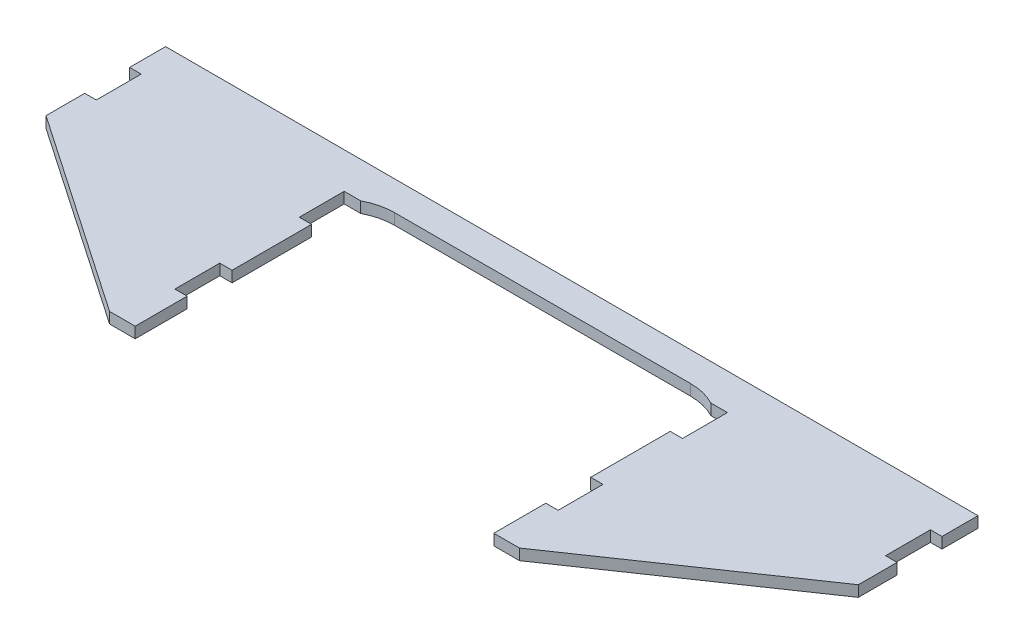
ISO-10303-21;
HEADER;
FILE_DESCRIPTION(('STEP AP214'),'2;1');
FILE_NAME('part.step','',(''),(''),'','','');
FILE_SCHEMA(('AUTOMOTIVE_DESIGN { 1 0 10303 214 1 1 1 1 }'));
ENDSEC;
DATA;
#1=APPLICATION_CONTEXT('core data for automotive mechanical design processes');
#2=APPLICATION_PROTOCOL_DEFINITION('international standard','automotive_design',2000,#1);
#3=PRODUCT_CONTEXT('',#1,'mechanical');
#4=PRODUCT('Part','Part','',(#3));
#5=PRODUCT_RELATED_PRODUCT_CATEGORY('part','',(#4));
#6=PRODUCT_DEFINITION_FORMATION('','',#4);
#7=PRODUCT_DEFINITION_CONTEXT('part definition',#1,'design');
#8=PRODUCT_DEFINITION('design','',#6,#7);
#9=PRODUCT_DEFINITION_SHAPE('','',#8);
#10=(LENGTH_UNIT() NAMED_UNIT(*) SI_UNIT(.MILLI.,.METRE.));
#11=(NAMED_UNIT(*) PLANE_ANGLE_UNIT() SI_UNIT($,.RADIAN.));
#12=(NAMED_UNIT(*) SI_UNIT($,.STERADIAN.) SOLID_ANGLE_UNIT());
#13=UNCERTAINTY_MEASURE_WITH_UNIT(LENGTH_MEASURE(1.E-05),#10,'distance_accuracy_value','');
#14=(GEOMETRIC_REPRESENTATION_CONTEXT(3) GLOBAL_UNCERTAINTY_ASSIGNED_CONTEXT((#13)) GLOBAL_UNIT_ASSIGNED_CONTEXT((#10,
#11,#12)) REPRESENTATION_CONTEXT('',''));
#15=CARTESIAN_POINT('',(0.,0.,0.));
#16=DIRECTION('',(0.,0.,1.));
#17=DIRECTION('',(1.,0.,0.));
#18=AXIS2_PLACEMENT_3D('',#15,#16,#17);
#19=CARTESIAN_POINT('',(-82.8040000000002,-4.99999999997031E-05,9.69232132136487));
#20=DIRECTION('',(0.,0.,1.));
#21=DIRECTION('',(1.,0.,0.));
#22=AXIS2_PLACEMENT_3D('',#19,#20,#21);
#23=PLANE('',#22);
#24=DIRECTION('',(1.,0.,0.));
#25=VECTOR('',#24,1.);
#26=CARTESIAN_POINT('',(-82.8040000000002,4.7625,9.69232132136487));
#27=LINE('',#26,#25);
#28=CARTESIAN_POINT('',(-83.1215000000002,4.7625,9.69232132136487));
#29=VERTEX_POINT('',#28);
#30=CARTESIAN_POINT('',(-77.7875,4.7625,9.69232132136487));
#31=VERTEX_POINT('',#30);
#32=EDGE_CURVE('E287',#29,#31,#27,.T.);
#33=ORIENTED_EDGE('',*,*,#32,.T.);
#34=DIRECTION('',(0.,1.,0.));
#35=VECTOR('',#34,1.);
#36=CARTESIAN_POINT('',(-77.7875,0.,9.69232132136487));
#37=LINE('',#36,#35);
#38=CARTESIAN_POINT('',(-77.7875,0.,9.69232132136487));
#39=VERTEX_POINT('',#38);
#40=EDGE_CURVE('E258',#39,#31,#37,.T.);
#41=ORIENTED_EDGE('',*,*,#40,.F.);
#42=DIRECTION('',(1.,0.,0.));
#43=VECTOR('',#42,1.);
#44=CARTESIAN_POINT('',(0.,0.,9.69232132136487));
#45=LINE('',#44,#43);
#46=CARTESIAN_POINT('',(-83.1215000000002,0.,9.69232132136487));
#47=VERTEX_POINT('',#46);
#48=EDGE_CURVE('E279',#47,#39,#45,.T.);
#49=ORIENTED_EDGE('',*,*,#48,.F.);
#50=DIRECTION('',(0.,1.,0.));
#51=VECTOR('',#50,1.);
#52=CARTESIAN_POINT('',(-83.1215000000002,0.,9.69232132136487));
#53=LINE('',#52,#51);
#54=EDGE_CURVE('E450',#47,#29,#53,.T.);
#55=ORIENTED_EDGE('',*,*,#54,.T.);
#56=EDGE_LOOP('',(#33,#41,#49,#55));
#57=FACE_BOUND('',#56,.T.);
#58=ADVANCED_FACE('F33',(#57),#23,.F.);
#59=CARTESIAN_POINT('',(0.,4.7625,0.));
#60=DIRECTION('',(0.,1.,0.));
#61=DIRECTION('',(0.,0.,1.));
#62=AXIS2_PLACEMENT_3D('',#59,#60,#61);
#63=PLANE('',#62);
#64=DIRECTION('',(0.,0.,1.));
#65=VECTOR('',#64,1.);
#66=CARTESIAN_POINT('',(-77.7875,4.7625,86.2203816674356));
#67=LINE('',#66,#65);
#68=CARTESIAN_POINT('',(-77.7875,4.7625,44.1959999999999));
#69=VERTEX_POINT('',#68);
#70=EDGE_CURVE('E48',#31,#69,#67,.T.);
#71=ORIENTED_EDGE('',*,*,#70,.F.);
#72=ORIENTED_EDGE('',*,*,#32,.F.);
#73=DIRECTION('',(0.,0.,1.));
#74=VECTOR('',#73,1.);
#75=CARTESIAN_POINT('',(-83.1215000000002,4.7625,-9.77899999999908));
#76=LINE('',#75,#74);
#77=CARTESIAN_POINT('',(-83.1215000000002,4.7625,-9.77899999999908));
#78=VERTEX_POINT('',#77);
#79=EDGE_CURVE('E441',#78,#29,#76,.T.);
#80=ORIENTED_EDGE('',*,*,#79,.F.);
#81=DIRECTION('',(-1.,0.,0.));
#82=VECTOR('',#81,1.);
#83=CARTESIAN_POINT('',(-82.8040000000002,4.7625,-9.77899999999908));
#84=LINE('',#83,#82);
#85=CARTESIAN_POINT('',(-75.9460000000002,4.7625,-9.77899999999907));
#86=VERTEX_POINT('',#85);
#87=EDGE_CURVE('E292',#86,#78,#84,.T.);
#88=ORIENTED_EDGE('',*,*,#87,.F.);
#89=CARTESIAN_POINT('',(-64.1199880348429,4.7625,12.7));
#90=DIRECTION('',(0.,1.,0.));
#91=DIRECTION('',(0.,0.,1.));
#92=AXIS2_PLACEMENT_3D('',#89,#90,#91);
#93=CIRCLE('',#92,25.4);
#94=CARTESIAN_POINT('',(-64.1199880348429,4.7625,-12.7));
#95=VERTEX_POINT('',#94);
#96=EDGE_CURVE('E461',#86,#95,#93,.F.);
#97=ORIENTED_EDGE('',*,*,#96,.T.);
#98=DIRECTION('',(1.,0.,0.));
#99=VECTOR('',#98,1.);
#100=CARTESIAN_POINT('',(0.,4.7625,-12.7));
#101=LINE('',#100,#99);
#102=CARTESIAN_POINT('',(64.1199880348425,4.7625,-12.7));
#103=VERTEX_POINT('',#102);
#104=EDGE_CURVE('E458',#95,#103,#101,.T.);
#105=ORIENTED_EDGE('',*,*,#104,.T.);
#106=CARTESIAN_POINT('',(64.1199880348425,4.7625,12.7));
#107=DIRECTION('',(0.,1.,0.));
#108=DIRECTION('',(0.,0.,1.));
#109=AXIS2_PLACEMENT_3D('',#106,#107,#108);
#110=CIRCLE('',#109,25.4);
#111=CARTESIAN_POINT('',(75.9459999999998,4.7625,-9.77899999999908));
#112=VERTEX_POINT('',#111);
#113=EDGE_CURVE('E453',#112,#103,#110,.T.);
#114=ORIENTED_EDGE('',*,*,#113,.F.);
#115=DIRECTION('',(-1.,0.,0.));
#116=VECTOR('',#115,1.);
#117=CARTESIAN_POINT('',(82.8039999999998,4.7625,-9.77899999999907));
#118=LINE('',#117,#116);
#119=CARTESIAN_POINT('',(83.1214999999998,4.7625,-9.7789999999991));
#120=VERTEX_POINT('',#119);
#121=EDGE_CURVE('E363',#120,#112,#118,.T.);
#122=ORIENTED_EDGE('',*,*,#121,.F.);
#123=DIRECTION('',(0.,0.,-1.));
#124=VECTOR('',#123,1.);
#125=CARTESIAN_POINT('',(83.1214999999998,4.7625,9.69232132136487));
#126=LINE('',#125,#124);
#127=CARTESIAN_POINT('',(83.1214999999998,4.7625,9.69232132136487));
#128=VERTEX_POINT('',#127);
#129=EDGE_CURVE('E411',#128,#120,#126,.T.);
#130=ORIENTED_EDGE('',*,*,#129,.F.);
#131=DIRECTION('',(1.,0.,0.));
#132=VECTOR('',#131,1.);
#133=CARTESIAN_POINT('',(82.8039999999998,4.7625,9.69232132136487));
#134=LINE('',#133,#132);
#135=CARTESIAN_POINT('',(77.7875,4.7625,9.69232132136487));
#136=VERTEX_POINT('',#135);
#137=EDGE_CURVE('E294',#136,#128,#134,.T.);
#138=ORIENTED_EDGE('',*,*,#137,.F.);
#139=DIRECTION('',(0.,0.,-1.));
#140=VECTOR('',#139,1.);
#141=CARTESIAN_POINT('',(77.7875,4.7625,86.2203816674356));
#142=LINE('',#141,#140);
#143=CARTESIAN_POINT('',(77.7875,4.7625,44.196));
#144=VERTEX_POINT('',#143);
#145=EDGE_CURVE('E254',#144,#136,#142,.T.);
#146=ORIENTED_EDGE('',*,*,#145,.F.);
#147=DIRECTION('',(-1.,0.,0.));
#148=VECTOR('',#147,1.);
#149=CARTESIAN_POINT('',(82.8039999999998,4.7625,44.1959999999999));
#150=LINE('',#149,#148);
#151=CARTESIAN_POINT('',(83.1214999999998,4.7625,44.1959999999999));
#152=VERTEX_POINT('',#151);
#153=EDGE_CURVE('E375',#152,#144,#150,.T.);
#154=ORIENTED_EDGE('',*,*,#153,.F.);
#155=DIRECTION('',(0.,0.,-1.));
#156=VECTOR('',#155,1.);
#157=CARTESIAN_POINT('',(83.1214999999998,4.7625,63.6673213213639));
#158=LINE('',#157,#156);
#159=CARTESIAN_POINT('',(83.1214999999998,4.7625,63.6673213213639));
#160=VERTEX_POINT('',#159);
#161=EDGE_CURVE('E420',#160,#152,#158,.T.);
#162=ORIENTED_EDGE('',*,*,#161,.F.);
#163=DIRECTION('',(1.,0.,0.));
#164=VECTOR('',#163,1.);
#165=CARTESIAN_POINT('',(82.8039999999998,4.7625,63.6673213213639));
#166=LINE('',#165,#164);
#167=CARTESIAN_POINT('',(77.7875,4.7625,63.6673213213639));
#168=VERTEX_POINT('',#167);
#169=EDGE_CURVE('E366',#168,#160,#166,.T.);
#170=ORIENTED_EDGE('',*,*,#169,.F.);
#171=DIRECTION('',(0.,0.,1.));
#172=VECTOR('',#171,1.);
#173=CARTESIAN_POINT('',(77.7875,4.7625,0.));
#174=LINE('',#173,#172);
#175=CARTESIAN_POINT('',(77.7875,4.7625,86.2203816674357));
#176=VERTEX_POINT('',#175);
#177=EDGE_CURVE('E488',#168,#176,#174,.T.);
#178=ORIENTED_EDGE('',*,*,#177,.T.);
#179=DIRECTION('',(1.,0.,0.));
#180=VECTOR('',#179,1.);
#181=CARTESIAN_POINT('',(88.9,4.7625,86.2203816674357));
#182=LINE('',#181,#180);
#183=CARTESIAN_POINT('',(88.9,4.7625,86.2203816674357));
#184=VERTEX_POINT('',#183);
#185=EDGE_CURVE('E324',#176,#184,#182,.T.);
#186=ORIENTED_EDGE('',*,*,#185,.T.);
#187=DIRECTION('',(0.825332935072794,0.,-0.564646390481802));
#188=VECTOR('',#187,1.);
#189=CARTESIAN_POINT('',(177.8,4.7625,25.4));
#190=LINE('',#189,#188);
#191=CARTESIAN_POINT('',(176.2125,4.7625,26.4860782440614));
#192=VERTEX_POINT('',#191);
#193=EDGE_CURVE('E334',#184,#192,#190,.T.);
#194=ORIENTED_EDGE('',*,*,#193,.T.);
#195=DIRECTION('',(0.,0.,1.));
#196=VECTOR('',#195,1.);
#197=CARTESIAN_POINT('',(176.2125,4.7625,0.));
#198=LINE('',#197,#196);
#199=CARTESIAN_POINT('',(176.2125,4.7625,9.69232132136446));
#200=VERTEX_POINT('',#199);
#201=EDGE_CURVE('E480',#200,#192,#198,.T.);
#202=ORIENTED_EDGE('',*,*,#201,.F.);
#203=DIRECTION('',(1.,0.,0.));
#204=VECTOR('',#203,1.);
#205=CARTESIAN_POINT('',(171.196,4.7625,9.69232132136446));
#206=LINE('',#205,#204);
#207=CARTESIAN_POINT('',(171.196,4.7625,9.69232132136446));
#208=VERTEX_POINT('',#207);
#209=EDGE_CURVE('E372',#208,#200,#206,.T.);
#210=ORIENTED_EDGE('',*,*,#209,.F.);
#211=DIRECTION('',(0.,0.,1.));
#212=VECTOR('',#211,1.);
#213=CARTESIAN_POINT('',(171.196,4.7625,9.69232132136446));
#214=LINE('',#213,#212);
#215=CARTESIAN_POINT('',(171.196,4.7625,-9.77899999999954));
#216=VERTEX_POINT('',#215);
#217=EDGE_CURVE('E371',#216,#208,#214,.T.);
#218=ORIENTED_EDGE('',*,*,#217,.F.);
#219=DIRECTION('',(-1.,0.,0.));
#220=VECTOR('',#219,1.);
#221=CARTESIAN_POINT('',(171.196,4.7625,-9.77899999999954));
#222=LINE('',#221,#220);
#223=CARTESIAN_POINT('',(176.2125,4.7625,-9.77899999999954));
#224=VERTEX_POINT('',#223);
#225=EDGE_CURVE('E378',#224,#216,#222,.T.);
#226=ORIENTED_EDGE('',*,*,#225,.F.);
#227=DIRECTION('',(0.,0.,1.));
#228=VECTOR('',#227,1.);
#229=CARTESIAN_POINT('',(176.2125,4.7625,0.));
#230=LINE('',#229,#228);
#231=CARTESIAN_POINT('',(176.2125,4.7625,-25.4));
#232=VERTEX_POINT('',#231);
#233=EDGE_CURVE('E473',#232,#224,#230,.T.);
#234=ORIENTED_EDGE('',*,*,#233,.F.);
#235=DIRECTION('',(-1.,0.,0.));
#236=VECTOR('',#235,1.);
#237=CARTESIAN_POINT('',(-177.8,4.7625,-25.4));
#238=LINE('',#237,#236);
#239=CARTESIAN_POINT('',(-176.2125,4.7625,-25.4));
#240=VERTEX_POINT('',#239);
#241=EDGE_CURVE('E321',#232,#240,#238,.T.);
#242=ORIENTED_EDGE('',*,*,#241,.T.);
#243=DIRECTION('',(0.,0.,1.));
#244=VECTOR('',#243,1.);
#245=CARTESIAN_POINT('',(-176.2125,4.7625,0.));
#246=LINE('',#245,#244);
#247=CARTESIAN_POINT('',(-176.2125,4.7625,-9.77899999999798));
#248=VERTEX_POINT('',#247);
#249=EDGE_CURVE('E503',#240,#248,#246,.T.);
#250=ORIENTED_EDGE('',*,*,#249,.T.);
#251=DIRECTION('',(-1.,0.,0.));
#252=VECTOR('',#251,1.);
#253=CARTESIAN_POINT('',(-171.196,4.7625,-9.77899999999798));
#254=LINE('',#253,#252);
#255=CARTESIAN_POINT('',(-171.196,4.7625,-9.77899999999798));
#256=VERTEX_POINT('',#255);
#257=EDGE_CURVE('E306',#256,#248,#254,.T.);
#258=ORIENTED_EDGE('',*,*,#257,.F.);
#259=DIRECTION('',(0.,0.,-1.));
#260=VECTOR('',#259,1.);
#261=CARTESIAN_POINT('',(-171.196,4.7625,9.69232132136601));
#262=LINE('',#261,#260);
#263=CARTESIAN_POINT('',(-171.196,4.7625,9.69232132136601));
#264=VERTEX_POINT('',#263);
#265=EDGE_CURVE('E301',#264,#256,#262,.T.);
#266=ORIENTED_EDGE('',*,*,#265,.F.);
#267=DIRECTION('',(1.,0.,0.));
#268=VECTOR('',#267,1.);
#269=CARTESIAN_POINT('',(-171.196,4.7625,9.69232132136601));
#270=LINE('',#269,#268);
#271=CARTESIAN_POINT('',(-176.2125,4.7625,9.69232132136601));
#272=VERTEX_POINT('',#271);
#273=EDGE_CURVE('E297',#272,#264,#270,.T.);
#274=ORIENTED_EDGE('',*,*,#273,.F.);
#275=DIRECTION('',(0.,0.,1.));
#276=VECTOR('',#275,1.);
#277=CARTESIAN_POINT('',(-176.2125,4.7625,0.));
#278=LINE('',#277,#276);
#279=CARTESIAN_POINT('',(-176.2125,4.7625,26.4860782440613));
#280=VERTEX_POINT('',#279);
#281=EDGE_CURVE('E511',#272,#280,#278,.T.);
#282=ORIENTED_EDGE('',*,*,#281,.T.);
#283=DIRECTION('',(0.825332935072794,0.,0.564646390481801));
#284=VECTOR('',#283,1.);
#285=CARTESIAN_POINT('',(-177.8,4.7625,25.4));
#286=LINE('',#285,#284);
#287=CARTESIAN_POINT('',(-88.9,4.7625,86.2203816674356));
#288=VERTEX_POINT('',#287);
#289=EDGE_CURVE('E318',#280,#288,#286,.T.);
#290=ORIENTED_EDGE('',*,*,#289,.T.);
#291=DIRECTION('',(1.,0.,0.));
#292=VECTOR('',#291,1.);
#293=CARTESIAN_POINT('',(-88.9,4.7625,86.2203816674356));
#294=LINE('',#293,#292);
#295=CARTESIAN_POINT('',(-77.7875,4.7625,86.2203816674356));
#296=VERTEX_POINT('',#295);
#297=EDGE_CURVE('E320',#288,#296,#294,.T.);
#298=ORIENTED_EDGE('',*,*,#297,.T.);
#299=DIRECTION('',(0.,0.,1.));
#300=VECTOR('',#299,1.);
#301=CARTESIAN_POINT('',(-77.7874999999999,4.7625,-1.43597153007449E-13));
#302=LINE('',#301,#300);
#303=CARTESIAN_POINT('',(-77.7875,4.7625,63.6673213213639));
#304=VERTEX_POINT('',#303);
#305=EDGE_CURVE('E495',#304,#296,#302,.T.);
#306=ORIENTED_EDGE('',*,*,#305,.F.);
#307=DIRECTION('',(1.,0.,0.));
#308=VECTOR('',#307,1.);
#309=CARTESIAN_POINT('',(-82.8040000000002,4.7625,63.6673213213639));
#310=LINE('',#309,#308);
#311=CARTESIAN_POINT('',(-83.1215000000002,4.7625,63.6673213213639));
#312=VERTEX_POINT('',#311);
#313=EDGE_CURVE('E304',#312,#304,#310,.T.);
#314=ORIENTED_EDGE('',*,*,#313,.F.);
#315=DIRECTION('',(0.,0.,1.));
#316=VECTOR('',#315,1.);
#317=CARTESIAN_POINT('',(-83.1215000000002,4.7625,44.1959999999999));
#318=LINE('',#317,#316);
#319=CARTESIAN_POINT('',(-83.1215000000002,4.7625,44.1959999999999));
#320=VERTEX_POINT('',#319);
#321=EDGE_CURVE('E429',#320,#312,#318,.T.);
#322=ORIENTED_EDGE('',*,*,#321,.F.);
#323=DIRECTION('',(-1.,0.,0.));
#324=VECTOR('',#323,1.);
#325=CARTESIAN_POINT('',(-82.8040000000002,4.7625,44.1959999999999));
#326=LINE('',#325,#324);
#327=EDGE_CURVE('E291',#69,#320,#326,.T.);
#328=ORIENTED_EDGE('',*,*,#327,.F.);
#329=EDGE_LOOP('',(#71,#72,#80,#88,#97,#105,#114,#122,#130,#138,#146,#154,#162,#170,#178,#186,
#194,#202,#210,#218,#226,#234,#242,#250,#258,#266,#274,#282,#290,#298,#306,#314,#322,#328));
#330=FACE_BOUND('',#329,.T.);
#331=ADVANCED_FACE('F35',(#330),#63,.T.);
#332=CARTESIAN_POINT('',(0.,0.,0.));
#333=DIRECTION('',(0.,1.,0.));
#334=DIRECTION('',(0.,0.,1.));
#335=AXIS2_PLACEMENT_3D('',#332,#333,#334);
#336=PLANE('',#335);
#337=ORIENTED_EDGE('',*,*,#48,.T.);
#338=DIRECTION('',(0.,0.,1.));
#339=VECTOR('',#338,1.);
#340=CARTESIAN_POINT('',(-77.7875,0.,86.2203816674356));
#341=LINE('',#340,#339);
#342=CARTESIAN_POINT('',(-77.7875,0.,44.196));
#343=VERTEX_POINT('',#342);
#344=EDGE_CURVE('E269',#39,#343,#341,.T.);
#345=ORIENTED_EDGE('',*,*,#344,.T.);
#346=DIRECTION('',(-1.,0.,0.));
#347=VECTOR('',#346,1.);
#348=CARTESIAN_POINT('',(0.,0.,44.1959999999999));
#349=LINE('',#348,#347);
#350=CARTESIAN_POINT('',(-83.1215000000002,0.,44.1959999999999));
#351=VERTEX_POINT('',#350);
#352=EDGE_CURVE('E354',#343,#351,#349,.T.);
#353=ORIENTED_EDGE('',*,*,#352,.T.);
#354=DIRECTION('',(0.,0.,1.));
#355=VECTOR('',#354,1.);
#356=CARTESIAN_POINT('',(-83.1215000000002,0.,44.1959999999999));
#357=LINE('',#356,#355);
#358=CARTESIAN_POINT('',(-83.1215000000002,0.,63.6673213213639));
#359=VERTEX_POINT('',#358);
#360=EDGE_CURVE('E432',#351,#359,#357,.T.);
#361=ORIENTED_EDGE('',*,*,#360,.T.);
#362=DIRECTION('',(1.,0.,0.));
#363=VECTOR('',#362,1.);
#364=CARTESIAN_POINT('',(0.,0.,63.6673213213639));
#365=LINE('',#364,#363);
#366=CARTESIAN_POINT('',(-77.7875,0.,63.6673213213639));
#367=VERTEX_POINT('',#366);
#368=EDGE_CURVE('E351',#359,#367,#365,.T.);
#369=ORIENTED_EDGE('',*,*,#368,.T.);
#370=DIRECTION('',(0.,0.,1.));
#371=VECTOR('',#370,1.);
#372=CARTESIAN_POINT('',(-77.7874999999999,0.,-1.43597153007449E-13));
#373=LINE('',#372,#371);
#374=CARTESIAN_POINT('',(-77.7875,0.,86.2203816674356));
#375=VERTEX_POINT('',#374);
#376=EDGE_CURVE('E500',#367,#375,#373,.T.);
#377=ORIENTED_EDGE('',*,*,#376,.T.);
#378=DIRECTION('',(1.,0.,0.));
#379=VECTOR('',#378,1.);
#380=CARTESIAN_POINT('',(-88.9,0.,86.2203816674356));
#381=LINE('',#380,#379);
#382=CARTESIAN_POINT('',(-88.9,0.,86.2203816674356));
#383=VERTEX_POINT('',#382);
#384=EDGE_CURVE('E314',#383,#375,#381,.T.);
#385=ORIENTED_EDGE('',*,*,#384,.F.);
#386=DIRECTION('',(0.825332935072794,0.,0.564646390481801));
#387=VECTOR('',#386,1.);
#388=CARTESIAN_POINT('',(-177.8,0.,25.4));
#389=LINE('',#388,#387);
#390=CARTESIAN_POINT('',(-176.2125,0.,26.4860782440613));
#391=VERTEX_POINT('',#390);
#392=EDGE_CURVE('E312',#391,#383,#389,.T.);
#393=ORIENTED_EDGE('',*,*,#392,.F.);
#394=DIRECTION('',(0.,0.,1.));
#395=VECTOR('',#394,1.);
#396=CARTESIAN_POINT('',(-176.2125,0.,0.));
#397=LINE('',#396,#395);
#398=CARTESIAN_POINT('',(-176.2125,0.,9.69232132136601));
#399=VERTEX_POINT('',#398);
#400=EDGE_CURVE('E343',#399,#391,#397,.T.);
#401=ORIENTED_EDGE('',*,*,#400,.F.);
#402=DIRECTION('',(1.,0.,0.));
#403=VECTOR('',#402,1.);
#404=CARTESIAN_POINT('',(0.,0.,9.69232132136601));
#405=LINE('',#404,#403);
#406=CARTESIAN_POINT('',(-171.196,0.,9.69232132136601));
#407=VERTEX_POINT('',#406);
#408=EDGE_CURVE('E347',#399,#407,#405,.T.);
#409=ORIENTED_EDGE('',*,*,#408,.T.);
#410=DIRECTION('',(0.,0.,-1.));
#411=VECTOR('',#410,1.);
#412=CARTESIAN_POINT('',(-171.196,0.,0.));
#413=LINE('',#412,#411);
#414=CARTESIAN_POINT('',(-171.196,0.,-9.77899999999798));
#415=VERTEX_POINT('',#414);
#416=EDGE_CURVE('E344',#407,#415,#413,.T.);
#417=ORIENTED_EDGE('',*,*,#416,.T.);
#418=DIRECTION('',(-1.,0.,0.));
#419=VECTOR('',#418,1.);
#420=CARTESIAN_POINT('',(0.,0.,-9.77899999999794));
#421=LINE('',#420,#419);
#422=CARTESIAN_POINT('',(-176.2125,0.,-9.77899999999798));
#423=VERTEX_POINT('',#422);
#424=EDGE_CURVE('E281',#415,#423,#421,.T.);
#425=ORIENTED_EDGE('',*,*,#424,.T.);
#426=DIRECTION('',(0.,0.,1.));
#427=VECTOR('',#426,1.);
#428=CARTESIAN_POINT('',(-176.2125,0.,0.));
#429=LINE('',#428,#427);
#430=CARTESIAN_POINT('',(-176.2125,0.,-25.4));
#431=VERTEX_POINT('',#430);
#432=EDGE_CURVE('E509',#431,#423,#429,.T.);
#433=ORIENTED_EDGE('',*,*,#432,.F.);
#434=DIRECTION('',(-1.,0.,0.));
#435=VECTOR('',#434,1.);
#436=CARTESIAN_POINT('',(-177.8,0.,-25.4));
#437=LINE('',#436,#435);
#438=CARTESIAN_POINT('',(176.2125,0.,-25.4));
#439=VERTEX_POINT('',#438);
#440=EDGE_CURVE('E341',#439,#431,#437,.T.);
#441=ORIENTED_EDGE('',*,*,#440,.F.);
#442=DIRECTION('',(0.,0.,1.));
#443=VECTOR('',#442,1.);
#444=CARTESIAN_POINT('',(176.2125,0.,0.));
#445=LINE('',#444,#443);
#446=CARTESIAN_POINT('',(176.2125,0.,-9.77899999999954));
#447=VERTEX_POINT('',#446);
#448=EDGE_CURVE('E477',#439,#447,#445,.T.);
#449=ORIENTED_EDGE('',*,*,#448,.T.);
#450=DIRECTION('',(-1.,0.,0.));
#451=VECTOR('',#450,1.);
#452=CARTESIAN_POINT('',(0.,0.,-9.77899999999954));
#453=LINE('',#452,#451);
#454=CARTESIAN_POINT('',(171.196,0.,-9.77899999999954));
#455=VERTEX_POINT('',#454);
#456=EDGE_CURVE('E276',#447,#455,#453,.T.);
#457=ORIENTED_EDGE('',*,*,#456,.T.);
#458=DIRECTION('',(0.,0.,1.));
#459=VECTOR('',#458,1.);
#460=CARTESIAN_POINT('',(171.196,0.,0.));
#461=LINE('',#460,#459);
#462=CARTESIAN_POINT('',(171.196,0.,9.69232132136446));
#463=VERTEX_POINT('',#462);
#464=EDGE_CURVE('E337',#455,#463,#461,.T.);
#465=ORIENTED_EDGE('',*,*,#464,.T.);
#466=DIRECTION('',(1.,0.,0.));
#467=VECTOR('',#466,1.);
#468=CARTESIAN_POINT('',(0.,0.,9.69232132136446));
#469=LINE('',#468,#467);
#470=CARTESIAN_POINT('',(176.2125,0.,9.69232132136446));
#471=VERTEX_POINT('',#470);
#472=EDGE_CURVE('E517',#463,#471,#469,.T.);
#473=ORIENTED_EDGE('',*,*,#472,.T.);
#474=DIRECTION('',(0.,0.,1.));
#475=VECTOR('',#474,1.);
#476=CARTESIAN_POINT('',(176.2125,0.,0.));
#477=LINE('',#476,#475);
#478=CARTESIAN_POINT('',(176.2125,0.,26.4860782440614));
#479=VERTEX_POINT('',#478);
#480=EDGE_CURVE('E485',#471,#479,#477,.T.);
#481=ORIENTED_EDGE('',*,*,#480,.T.);
#482=DIRECTION('',(0.825332935072794,0.,-0.564646390481802));
#483=VECTOR('',#482,1.);
#484=CARTESIAN_POINT('',(177.8,0.,25.4));
#485=LINE('',#484,#483);
#486=CARTESIAN_POINT('',(88.9,0.,86.2203816674357));
#487=VERTEX_POINT('',#486);
#488=EDGE_CURVE('E329',#487,#479,#485,.T.);
#489=ORIENTED_EDGE('',*,*,#488,.F.);
#490=DIRECTION('',(1.,0.,0.));
#491=VECTOR('',#490,1.);
#492=CARTESIAN_POINT('',(88.9,0.,86.2203816674357));
#493=LINE('',#492,#491);
#494=CARTESIAN_POINT('',(77.7875,0.,86.2203816674357));
#495=VERTEX_POINT('',#494);
#496=EDGE_CURVE('E327',#495,#487,#493,.T.);
#497=ORIENTED_EDGE('',*,*,#496,.F.);
#498=DIRECTION('',(0.,0.,1.));
#499=VECTOR('',#498,1.);
#500=CARTESIAN_POINT('',(77.7875,0.,0.));
#501=LINE('',#500,#499);
#502=CARTESIAN_POINT('',(77.7875,0.,63.6673213213639));
#503=VERTEX_POINT('',#502);
#504=EDGE_CURVE('E493',#503,#495,#501,.T.);
#505=ORIENTED_EDGE('',*,*,#504,.F.);
#506=DIRECTION('',(1.,0.,0.));
#507=VECTOR('',#506,1.);
#508=CARTESIAN_POINT('',(0.,0.,63.6673213213639));
#509=LINE('',#508,#507);
#510=CARTESIAN_POINT('',(83.1214999999998,0.,63.6673213213639));
#511=VERTEX_POINT('',#510);
#512=EDGE_CURVE('E284',#503,#511,#509,.T.);
#513=ORIENTED_EDGE('',*,*,#512,.T.);
#514=DIRECTION('',(0.,0.,-1.));
#515=VECTOR('',#514,1.);
#516=CARTESIAN_POINT('',(83.1214999999998,0.,63.6673213213639));
#517=LINE('',#516,#515);
#518=CARTESIAN_POINT('',(83.1214999999998,0.,44.1959999999999));
#519=VERTEX_POINT('',#518);
#520=EDGE_CURVE('E422',#511,#519,#517,.T.);
#521=ORIENTED_EDGE('',*,*,#520,.T.);
#522=DIRECTION('',(-1.,0.,0.));
#523=VECTOR('',#522,1.);
#524=CARTESIAN_POINT('',(0.,0.,44.1959999999999));
#525=LINE('',#524,#523);
#526=CARTESIAN_POINT('',(77.7875,0.,44.1959999999999));
#527=VERTEX_POINT('',#526);
#528=EDGE_CURVE('E268',#519,#527,#525,.T.);
#529=ORIENTED_EDGE('',*,*,#528,.T.);
#530=DIRECTION('',(0.,0.,-1.));
#531=VECTOR('',#530,1.);
#532=CARTESIAN_POINT('',(77.7875,0.,86.2203816674356));
#533=LINE('',#532,#531);
#534=CARTESIAN_POINT('',(77.7875,0.,9.69232132136487));
#535=VERTEX_POINT('',#534);
#536=EDGE_CURVE('E55',#527,#535,#533,.T.);
#537=ORIENTED_EDGE('',*,*,#536,.T.);
#538=DIRECTION('',(1.,0.,0.));
#539=VECTOR('',#538,1.);
#540=CARTESIAN_POINT('',(0.,0.,9.69232132136487));
#541=LINE('',#540,#539);
#542=CARTESIAN_POINT('',(83.1214999999998,0.,9.69232132136487));
#543=VERTEX_POINT('',#542);
#544=EDGE_CURVE('E265',#535,#543,#541,.T.);
#545=ORIENTED_EDGE('',*,*,#544,.T.);
#546=DIRECTION('',(0.,0.,-1.));
#547=VECTOR('',#546,1.);
#548=CARTESIAN_POINT('',(83.1214999999998,0.,9.69232132136487));
#549=LINE('',#548,#547);
#550=CARTESIAN_POINT('',(83.1214999999998,0.,-9.7789999999991));
#551=VERTEX_POINT('',#550);
#552=EDGE_CURVE('E413',#543,#551,#549,.T.);
#553=ORIENTED_EDGE('',*,*,#552,.T.);
#554=DIRECTION('',(-1.,0.,0.));
#555=VECTOR('',#554,1.);
#556=CARTESIAN_POINT('',(0.,0.,-9.7789999999991));
#557=LINE('',#556,#555);
#558=CARTESIAN_POINT('',(75.9459999999998,0.,-9.77899999999908));
#559=VERTEX_POINT('',#558);
#560=EDGE_CURVE('E275',#551,#559,#557,.T.);
#561=ORIENTED_EDGE('',*,*,#560,.T.);
#562=CARTESIAN_POINT('',(64.1199880348425,0.,12.7));
#563=DIRECTION('',(0.,1.,0.));
#564=DIRECTION('',(0.,0.,1.));
#565=AXIS2_PLACEMENT_3D('',#562,#563,#564);
#566=CIRCLE('',#565,25.4);
#567=CARTESIAN_POINT('',(64.1199880348425,0.,-12.7));
#568=VERTEX_POINT('',#567);
#569=EDGE_CURVE('E467',#559,#568,#566,.T.);
#570=ORIENTED_EDGE('',*,*,#569,.T.);
#571=DIRECTION('',(1.,0.,0.));
#572=VECTOR('',#571,1.);
#573=CARTESIAN_POINT('',(0.,0.,-12.7));
#574=LINE('',#573,#572);
#575=CARTESIAN_POINT('',(-64.1199880348429,0.,-12.7));
#576=VERTEX_POINT('',#575);
#577=EDGE_CURVE('E397',#576,#568,#574,.T.);
#578=ORIENTED_EDGE('',*,*,#577,.F.);
#579=CARTESIAN_POINT('',(-64.1199880348429,0.,12.7));
#580=DIRECTION('',(0.,1.,0.));
#581=DIRECTION('',(0.,0.,1.));
#582=AXIS2_PLACEMENT_3D('',#579,#580,#581);
#583=CIRCLE('',#582,25.4);
#584=CARTESIAN_POINT('',(-75.9460000000002,0.,-9.77899999999907));
#585=VERTEX_POINT('',#584);
#586=EDGE_CURVE('E471',#585,#576,#583,.F.);
#587=ORIENTED_EDGE('',*,*,#586,.F.);
#588=DIRECTION('',(-1.,0.,0.));
#589=VECTOR('',#588,1.);
#590=CARTESIAN_POINT('',(0.,0.,-9.77899999999906));
#591=LINE('',#590,#589);
#592=CARTESIAN_POINT('',(-83.1215000000002,0.,-9.77899999999908));
#593=VERTEX_POINT('',#592);
#594=EDGE_CURVE('E332',#585,#593,#591,.T.);
#595=ORIENTED_EDGE('',*,*,#594,.T.);
#596=DIRECTION('',(0.,0.,1.));
#597=VECTOR('',#596,1.);
#598=CARTESIAN_POINT('',(-83.1215000000002,0.,-9.77899999999908));
#599=LINE('',#598,#597);
#600=EDGE_CURVE('E444',#593,#47,#599,.T.);
#601=ORIENTED_EDGE('',*,*,#600,.T.);
#602=EDGE_LOOP('',(#337,#345,#353,#361,#369,#377,#385,#393,#401,#409,#417,#425,#433,#441,#449,
#457,#465,#473,#481,#489,#497,#505,#513,#521,#529,#537,#545,#553,#561,#570,#578,#587,#595,#601));
#603=FACE_BOUND('',#602,.T.);
#604=ADVANCED_FACE('F263',(#603),#336,.F.);
#605=CARTESIAN_POINT('',(88.9,0.,86.2203816674357));
#606=DIRECTION('',(0.,0.,1.));
#607=DIRECTION('',(1.,0.,0.));
#608=AXIS2_PLACEMENT_3D('',#605,#606,#607);
#609=PLANE('',#608);
#610=ORIENTED_EDGE('',*,*,#185,.F.);
#611=DIRECTION('',(0.,1.,0.));
#612=VECTOR('',#611,1.);
#613=CARTESIAN_POINT('',(77.7875,-4.99999999997031E-05,86.2203816674357));
#614=LINE('',#613,#612);
#615=EDGE_CURVE('E491',#495,#176,#614,.T.);
#616=ORIENTED_EDGE('',*,*,#615,.F.);
#617=ORIENTED_EDGE('',*,*,#496,.T.);
#618=DIRECTION('',(0.,1.,0.));
#619=VECTOR('',#618,1.);
#620=CARTESIAN_POINT('',(88.9,0.,86.2203816674357));
#621=LINE('',#620,#619);
#622=EDGE_CURVE('E317',#487,#184,#621,.T.);
#623=ORIENTED_EDGE('',*,*,#622,.T.);
#624=EDGE_LOOP('',(#610,#616,#617,#623));
#625=FACE_BOUND('',#624,.T.);
#626=ADVANCED_FACE('F538',(#625),#609,.T.);
#627=CARTESIAN_POINT('',(82.8039999999998,-4.99999999997031E-05,63.6673213213639));
#628=DIRECTION('',(0.,0.,1.));
#629=DIRECTION('',(1.,0.,0.));
#630=AXIS2_PLACEMENT_3D('',#627,#628,#629);
#631=PLANE('',#630);
#632=DIRECTION('',(0.,-1.,0.));
#633=VECTOR('',#632,1.);
#634=CARTESIAN_POINT('',(77.7875,-4.99999999997031E-05,63.6673213213639));
#635=LINE('',#634,#633);
#636=EDGE_CURVE('E389',#168,#503,#635,.T.);
#637=ORIENTED_EDGE('',*,*,#636,.F.);
#638=ORIENTED_EDGE('',*,*,#169,.T.);
#639=DIRECTION('',(0.,1.,0.));
#640=VECTOR('',#639,1.);
#641=CARTESIAN_POINT('',(83.1214999999998,0.,63.6673213213639));
#642=LINE('',#641,#640);
#643=EDGE_CURVE('E424',#511,#160,#642,.T.);
#644=ORIENTED_EDGE('',*,*,#643,.F.);
#645=ORIENTED_EDGE('',*,*,#512,.F.);
#646=EDGE_LOOP('',(#637,#638,#644,#645));
#647=FACE_BOUND('',#646,.T.);
#648=ADVANCED_FACE('F530',(#647),#631,.F.);
#649=CARTESIAN_POINT('',(-177.8,4.7625,-25.4));
#650=DIRECTION('',(0.,0.,1.));
#651=DIRECTION('',(1.,0.,0.));
#652=AXIS2_PLACEMENT_3D('',#649,#650,#651);
#653=PLANE('',#652);
#654=ORIENTED_EDGE('',*,*,#241,.F.);
#655=DIRECTION('',(0.,1.,0.));
#656=VECTOR('',#655,1.);
#657=CARTESIAN_POINT('',(176.2125,-4.99999999997031E-05,-25.4));
#658=LINE('',#657,#656);
#659=EDGE_CURVE('E475',#439,#232,#658,.T.);
#660=ORIENTED_EDGE('',*,*,#659,.F.);
#661=ORIENTED_EDGE('',*,*,#440,.T.);
#662=DIRECTION('',(0.,1.,0.));
#663=VECTOR('',#662,1.);
#664=CARTESIAN_POINT('',(-176.2125,-4.99999999997031E-05,-25.4));
#665=LINE('',#664,#663);
#666=EDGE_CURVE('E506',#431,#240,#665,.T.);
#667=ORIENTED_EDGE('',*,*,#666,.T.);
#668=EDGE_LOOP('',(#654,#660,#661,#667));
#669=FACE_BOUND('',#668,.T.);
#670=ADVANCED_FACE('F568',(#669),#653,.F.);
#671=CARTESIAN_POINT('',(-171.196,-4.99999999997031E-05,-9.77899999999798));
#672=DIRECTION('',(0.,0.,-1.));
#673=DIRECTION('',(-1.,0.,0.));
#674=AXIS2_PLACEMENT_3D('',#671,#672,#673);
#675=PLANE('',#674);
#676=DIRECTION('',(0.,1.,0.));
#677=VECTOR('',#676,1.);
#678=CARTESIAN_POINT('',(-176.2125,-4.99999999997031E-05,-9.77899999999798));
#679=LINE('',#678,#677);
#680=EDGE_CURVE('E384',#423,#248,#679,.T.);
#681=ORIENTED_EDGE('',*,*,#680,.F.);
#682=ORIENTED_EDGE('',*,*,#424,.F.);
#683=DIRECTION('',(0.,1.,0.));
#684=VECTOR('',#683,1.);
#685=CARTESIAN_POINT('',(-171.196,-4.99999999997031E-05,-9.77899999999798));
#686=LINE('',#685,#684);
#687=EDGE_CURVE('E299',#415,#256,#686,.T.);
#688=ORIENTED_EDGE('',*,*,#687,.T.);
#689=ORIENTED_EDGE('',*,*,#257,.T.);
#690=EDGE_LOOP('',(#681,#682,#688,#689));
#691=FACE_BOUND('',#690,.T.);
#692=ADVANCED_FACE('F576',(#691),#675,.F.);
#693=CARTESIAN_POINT('',(-177.8,0.,25.4));
#694=DIRECTION('',(-0.564646390481802,0.,0.825332935072794));
#695=DIRECTION('',(0.825332935072794,0.,0.564646390481802));
#696=AXIS2_PLACEMENT_3D('',#693,#694,#695);
#697=PLANE('',#696);
#698=ORIENTED_EDGE('',*,*,#289,.F.);
#699=DIRECTION('',(0.,1.,0.));
#700=VECTOR('',#699,1.);
#701=CARTESIAN_POINT('',(-176.2125,-4.99999999997031E-05,26.4860782440613));
#702=LINE('',#701,#700);
#703=EDGE_CURVE('E514',#391,#280,#702,.T.);
#704=ORIENTED_EDGE('',*,*,#703,.F.);
#705=ORIENTED_EDGE('',*,*,#392,.T.);
#706=DIRECTION('',(0.,1.,0.));
#707=VECTOR('',#706,1.);
#708=CARTESIAN_POINT('',(-88.9,0.,86.2203816674356));
#709=LINE('',#708,#707);
#710=EDGE_CURVE('E300',#383,#288,#709,.T.);
#711=ORIENTED_EDGE('',*,*,#710,.T.);
#712=EDGE_LOOP('',(#698,#704,#705,#711));
#713=FACE_BOUND('',#712,.T.);
#714=ADVANCED_FACE('F596',(#713),#697,.T.);
#715=CARTESIAN_POINT('',(-171.196,-4.99999999997031E-05,9.69232132136601));
#716=DIRECTION('',(0.,0.,1.));
#717=DIRECTION('',(1.,0.,0.));
#718=AXIS2_PLACEMENT_3D('',#715,#716,#717);
#719=PLANE('',#718);
#720=DIRECTION('',(0.,-1.,0.));
#721=VECTOR('',#720,1.);
#722=CARTESIAN_POINT('',(-176.2125,-4.99999999997031E-05,9.69232132136601));
#723=LINE('',#722,#721);
#724=EDGE_CURVE('E380',#272,#399,#723,.T.);
#725=ORIENTED_EDGE('',*,*,#724,.F.);
#726=ORIENTED_EDGE('',*,*,#273,.T.);
#727=DIRECTION('',(0.,1.,0.));
#728=VECTOR('',#727,1.);
#729=CARTESIAN_POINT('',(-171.196,-4.99999999997031E-05,9.69232132136601));
#730=LINE('',#729,#728);
#731=EDGE_CURVE('E305',#407,#264,#730,.T.);
#732=ORIENTED_EDGE('',*,*,#731,.F.);
#733=ORIENTED_EDGE('',*,*,#408,.F.);
#734=EDGE_LOOP('',(#725,#726,#732,#733));
#735=FACE_BOUND('',#734,.T.);
#736=ADVANCED_FACE('F586',(#735),#719,.F.);
#737=CARTESIAN_POINT('',(177.8,0.,25.4));
#738=DIRECTION('',(0.564646390481802,0.,0.825332935072794));
#739=DIRECTION('',(0.825332935072794,0.,-0.564646390481802));
#740=AXIS2_PLACEMENT_3D('',#737,#738,#739);
#741=PLANE('',#740);
#742=DIRECTION('',(0.,1.,0.));
#743=VECTOR('',#742,1.);
#744=CARTESIAN_POINT('',(176.2125,-4.99999999997031E-05,26.4860782440614));
#745=LINE('',#744,#743);
#746=EDGE_CURVE('E482',#479,#192,#745,.T.);
#747=ORIENTED_EDGE('',*,*,#746,.T.);
#748=ORIENTED_EDGE('',*,*,#193,.F.);
#749=ORIENTED_EDGE('',*,*,#622,.F.);
#750=ORIENTED_EDGE('',*,*,#488,.T.);
#751=EDGE_LOOP('',(#747,#748,#749,#750));
#752=FACE_BOUND('',#751,.T.);
#753=ADVANCED_FACE('F543',(#752),#741,.T.);
#754=CARTESIAN_POINT('',(-88.9,0.,86.2203816674356));
#755=DIRECTION('',(0.,0.,1.));
#756=DIRECTION('',(1.,0.,0.));
#757=AXIS2_PLACEMENT_3D('',#754,#755,#756);
#758=PLANE('',#757);
#759=DIRECTION('',(0.,1.,0.));
#760=VECTOR('',#759,1.);
#761=CARTESIAN_POINT('',(-77.7875,-4.99999999997031E-05,86.2203816674356));
#762=LINE('',#761,#760);
#763=EDGE_CURVE('E497',#375,#296,#762,.T.);
#764=ORIENTED_EDGE('',*,*,#763,.T.);
#765=ORIENTED_EDGE('',*,*,#297,.F.);
#766=ORIENTED_EDGE('',*,*,#710,.F.);
#767=ORIENTED_EDGE('',*,*,#384,.T.);
#768=EDGE_LOOP('',(#764,#765,#766,#767));
#769=FACE_BOUND('',#768,.T.);
#770=ADVANCED_FACE('F599',(#769),#758,.T.);
#771=CARTESIAN_POINT('',(-171.196,-4.99999999997031E-05,9.69232132136601));
#772=DIRECTION('',(1.,0.,0.));
#773=DIRECTION('',(0.,0.,-1.));
#774=AXIS2_PLACEMENT_3D('',#771,#772,#773);
#775=PLANE('',#774);
#776=ORIENTED_EDGE('',*,*,#731,.T.);
#777=ORIENTED_EDGE('',*,*,#265,.T.);
#778=ORIENTED_EDGE('',*,*,#687,.F.);
#779=ORIENTED_EDGE('',*,*,#416,.F.);
#780=EDGE_LOOP('',(#776,#777,#778,#779));
#781=FACE_BOUND('',#780,.T.);
#782=ADVANCED_FACE('F580',(#781),#775,.F.);
#783=CARTESIAN_POINT('',(-82.8040000000002,-4.99999999997031E-05,63.6673213213639));
#784=DIRECTION('',(0.,0.,1.));
#785=DIRECTION('',(1.,0.,0.));
#786=AXIS2_PLACEMENT_3D('',#783,#784,#785);
#787=PLANE('',#786);
#788=ORIENTED_EDGE('',*,*,#313,.T.);
#789=DIRECTION('',(0.,-1.,0.));
#790=VECTOR('',#789,1.);
#791=CARTESIAN_POINT('',(-77.7875,-4.99999999997031E-05,63.6673213213639));
#792=LINE('',#791,#790);
#793=EDGE_CURVE('E386',#304,#367,#792,.T.);
#794=ORIENTED_EDGE('',*,*,#793,.T.);
#795=ORIENTED_EDGE('',*,*,#368,.F.);
#796=DIRECTION('',(0.,1.,0.));
#797=VECTOR('',#796,1.);
#798=CARTESIAN_POINT('',(-83.1215000000002,0.,63.6673213213639));
#799=LINE('',#798,#797);
#800=EDGE_CURVE('E438',#359,#312,#799,.T.);
#801=ORIENTED_EDGE('',*,*,#800,.T.);
#802=EDGE_LOOP('',(#788,#794,#795,#801));
#803=FACE_BOUND('',#802,.T.);
#804=ADVANCED_FACE('F604',(#803),#787,.F.);
#805=CARTESIAN_POINT('',(-82.8040000000002,-4.99999999997031E-05,44.1959999999999));
#806=DIRECTION('',(0.,0.,-1.));
#807=DIRECTION('',(-1.,0.,0.));
#808=AXIS2_PLACEMENT_3D('',#805,#806,#807);
#809=PLANE('',#808);
#810=ORIENTED_EDGE('',*,*,#352,.F.);
#811=DIRECTION('',(0.,1.,0.));
#812=VECTOR('',#811,1.);
#813=CARTESIAN_POINT('',(-77.7875,-4.99999999997031E-05,44.1959999999999));
#814=LINE('',#813,#812);
#815=EDGE_CURVE('E11',#343,#69,#814,.T.);
#816=ORIENTED_EDGE('',*,*,#815,.T.);
#817=ORIENTED_EDGE('',*,*,#327,.T.);
#818=DIRECTION('',(0.,1.,0.));
#819=VECTOR('',#818,1.);
#820=CARTESIAN_POINT('',(-83.1215000000002,0.,44.1959999999999));
#821=LINE('',#820,#819);
#822=EDGE_CURVE('E435',#351,#320,#821,.T.);
#823=ORIENTED_EDGE('',*,*,#822,.F.);
#824=EDGE_LOOP('',(#810,#816,#817,#823));
#825=FACE_BOUND('',#824,.T.);
#826=ADVANCED_FACE('F613',(#825),#809,.F.);
#827=CARTESIAN_POINT('',(-82.8040000000002,-4.99999999997031E-05,-9.77899999999908));
#828=DIRECTION('',(0.,0.,-1.));
#829=DIRECTION('',(-1.,0.,0.));
#830=AXIS2_PLACEMENT_3D('',#827,#828,#829);
#831=PLANE('',#830);
#832=DIRECTION('',(0.,1.,0.));
#833=VECTOR('',#832,1.);
#834=CARTESIAN_POINT('',(-75.9460000000002,-4.99999999997031E-05,-9.77899999999907));
#835=LINE('',#834,#833);
#836=EDGE_CURVE('E290',#585,#86,#835,.T.);
#837=ORIENTED_EDGE('',*,*,#836,.T.);
#838=ORIENTED_EDGE('',*,*,#87,.T.);
#839=DIRECTION('',(0.,1.,0.));
#840=VECTOR('',#839,1.);
#841=CARTESIAN_POINT('',(-83.1215000000002,0.,-9.77899999999908));
#842=LINE('',#841,#840);
#843=EDGE_CURVE('E447',#593,#78,#842,.T.);
#844=ORIENTED_EDGE('',*,*,#843,.F.);
#845=ORIENTED_EDGE('',*,*,#594,.F.);
#846=EDGE_LOOP('',(#837,#838,#844,#845));
#847=FACE_BOUND('',#846,.T.);
#848=ADVANCED_FACE('F625',(#847),#831,.F.);
#849=CARTESIAN_POINT('',(82.8039999999998,-4.99999999997031E-05,9.69232132136487));
#850=DIRECTION('',(0.,0.,1.));
#851=DIRECTION('',(1.,0.,0.));
#852=AXIS2_PLACEMENT_3D('',#849,#850,#851);
#853=PLANE('',#852);
#854=ORIENTED_EDGE('',*,*,#544,.F.);
#855=DIRECTION('',(0.,1.,0.));
#856=VECTOR('',#855,1.);
#857=CARTESIAN_POINT('',(77.7875,0.,9.69232132136487));
#858=LINE('',#857,#856);
#859=EDGE_CURVE('E251',#535,#136,#858,.T.);
#860=ORIENTED_EDGE('',*,*,#859,.T.);
#861=ORIENTED_EDGE('',*,*,#137,.T.);
#862=DIRECTION('',(0.,1.,0.));
#863=VECTOR('',#862,1.);
#864=CARTESIAN_POINT('',(83.1214999999998,0.,9.69232132136487));
#865=LINE('',#864,#863);
#866=EDGE_CURVE('E273',#543,#128,#865,.T.);
#867=ORIENTED_EDGE('',*,*,#866,.F.);
#868=EDGE_LOOP('',(#854,#860,#861,#867));
#869=FACE_BOUND('',#868,.T.);
#870=ADVANCED_FACE('F271',(#869),#853,.F.);
#871=CARTESIAN_POINT('',(82.8039999999998,-4.99999999997031E-05,-9.77899999999907));
#872=DIRECTION('',(0.,0.,-1.));
#873=DIRECTION('',(-1.,0.,0.));
#874=AXIS2_PLACEMENT_3D('',#871,#872,#873);
#875=PLANE('',#874);
#876=ORIENTED_EDGE('',*,*,#560,.F.);
#877=DIRECTION('',(0.,1.,0.));
#878=VECTOR('',#877,1.);
#879=CARTESIAN_POINT('',(83.1214999999998,0.,-9.7789999999991));
#880=LINE('',#879,#878);
#881=EDGE_CURVE('E417',#551,#120,#880,.T.);
#882=ORIENTED_EDGE('',*,*,#881,.T.);
#883=ORIENTED_EDGE('',*,*,#121,.T.);
#884=DIRECTION('',(0.,1.,0.));
#885=VECTOR('',#884,1.);
#886=CARTESIAN_POINT('',(75.9459999999998,-4.99999999997031E-05,-9.77899999999908));
#887=LINE('',#886,#885);
#888=EDGE_CURVE('E361',#559,#112,#887,.T.);
#889=ORIENTED_EDGE('',*,*,#888,.F.);
#890=EDGE_LOOP('',(#876,#882,#883,#889));
#891=FACE_BOUND('',#890,.T.);
#892=ADVANCED_FACE('F641',(#891),#875,.F.);
#893=CARTESIAN_POINT('',(82.8039999999998,-4.99999999997031E-05,44.1959999999999));
#894=DIRECTION('',(0.,0.,-1.));
#895=DIRECTION('',(-1.,0.,0.));
#896=AXIS2_PLACEMENT_3D('',#893,#894,#895);
#897=PLANE('',#896);
#898=ORIENTED_EDGE('',*,*,#153,.T.);
#899=DIRECTION('',(0.,-1.,0.));
#900=VECTOR('',#899,1.);
#901=CARTESIAN_POINT('',(77.7875,-4.99999999997031E-05,44.1959999999999));
#902=LINE('',#901,#900);
#903=EDGE_CURVE('E41',#144,#527,#902,.T.);
#904=ORIENTED_EDGE('',*,*,#903,.T.);
#905=ORIENTED_EDGE('',*,*,#528,.F.);
#906=DIRECTION('',(0.,1.,0.));
#907=VECTOR('',#906,1.);
#908=CARTESIAN_POINT('',(83.1214999999998,0.,44.1959999999999));
#909=LINE('',#908,#907);
#910=EDGE_CURVE('E427',#519,#152,#909,.T.);
#911=ORIENTED_EDGE('',*,*,#910,.T.);
#912=EDGE_LOOP('',(#898,#904,#905,#911));
#913=FACE_BOUND('',#912,.T.);
#914=ADVANCED_FACE('F400',(#913),#897,.F.);
#915=CARTESIAN_POINT('',(171.196,-4.99999999997031E-05,9.69232132136446));
#916=DIRECTION('',(0.,0.,1.));
#917=DIRECTION('',(1.,0.,0.));
#918=AXIS2_PLACEMENT_3D('',#915,#916,#917);
#919=PLANE('',#918);
#920=ORIENTED_EDGE('',*,*,#209,.T.);
#921=DIRECTION('',(0.,-1.,0.));
#922=VECTOR('',#921,1.);
#923=CARTESIAN_POINT('',(176.2125,-4.99999999997031E-05,9.69232132136446));
#924=LINE('',#923,#922);
#925=EDGE_CURVE('E391',#200,#471,#924,.T.);
#926=ORIENTED_EDGE('',*,*,#925,.T.);
#927=ORIENTED_EDGE('',*,*,#472,.F.);
#928=DIRECTION('',(0.,1.,0.));
#929=VECTOR('',#928,1.);
#930=CARTESIAN_POINT('',(171.196,-4.99999999997031E-05,9.69232132136446));
#931=LINE('',#930,#929);
#932=EDGE_CURVE('E373',#463,#208,#931,.T.);
#933=ORIENTED_EDGE('',*,*,#932,.T.);
#934=EDGE_LOOP('',(#920,#926,#927,#933));
#935=FACE_BOUND('',#934,.T.);
#936=ADVANCED_FACE('F549',(#935),#919,.F.);
#937=CARTESIAN_POINT('',(171.196,-4.99999999997031E-05,9.69232132136446));
#938=DIRECTION('',(-1.,0.,0.));
#939=DIRECTION('',(0.,0.,1.));
#940=AXIS2_PLACEMENT_3D('',#937,#938,#939);
#941=PLANE('',#940);
#942=DIRECTION('',(0.,1.,0.));
#943=VECTOR('',#942,1.);
#944=CARTESIAN_POINT('',(171.196,-4.99999999997031E-05,-9.77899999999954));
#945=LINE('',#944,#943);
#946=EDGE_CURVE('E368',#455,#216,#945,.T.);
#947=ORIENTED_EDGE('',*,*,#946,.T.);
#948=ORIENTED_EDGE('',*,*,#217,.T.);
#949=ORIENTED_EDGE('',*,*,#932,.F.);
#950=ORIENTED_EDGE('',*,*,#464,.F.);
#951=EDGE_LOOP('',(#947,#948,#949,#950));
#952=FACE_BOUND('',#951,.T.);
#953=ADVANCED_FACE('F553',(#952),#941,.F.);
#954=CARTESIAN_POINT('',(171.196,-4.99999999997031E-05,-9.77899999999954));
#955=DIRECTION('',(0.,0.,-1.));
#956=DIRECTION('',(-1.,0.,0.));
#957=AXIS2_PLACEMENT_3D('',#954,#955,#956);
#958=PLANE('',#957);
#959=ORIENTED_EDGE('',*,*,#456,.F.);
#960=DIRECTION('',(0.,1.,0.));
#961=VECTOR('',#960,1.);
#962=CARTESIAN_POINT('',(176.2125,-4.99999999997031E-05,-9.77899999999954));
#963=LINE('',#962,#961);
#964=EDGE_CURVE('E394',#447,#224,#963,.T.);
#965=ORIENTED_EDGE('',*,*,#964,.T.);
#966=ORIENTED_EDGE('',*,*,#225,.T.);
#967=ORIENTED_EDGE('',*,*,#946,.F.);
#968=EDGE_LOOP('',(#959,#965,#966,#967));
#969=FACE_BOUND('',#968,.T.);
#970=ADVANCED_FACE('F560',(#969),#958,.F.);
#971=CARTESIAN_POINT('',(-176.2125,-4.99999999997031E-05,0.));
#972=DIRECTION('',(-1.,0.,0.));
#973=DIRECTION('',(0.,0.,1.));
#974=AXIS2_PLACEMENT_3D('',#971,#972,#973);
#975=PLANE('',#974);
#976=ORIENTED_EDGE('',*,*,#400,.T.);
#977=ORIENTED_EDGE('',*,*,#703,.T.);
#978=ORIENTED_EDGE('',*,*,#281,.F.);
#979=ORIENTED_EDGE('',*,*,#724,.T.);
#980=EDGE_LOOP('',(#976,#977,#978,#979));
#981=FACE_BOUND('',#980,.T.);
#982=ADVANCED_FACE('F590',(#981),#975,.T.);
#983=CARTESIAN_POINT('',(-176.2125,-4.99999999997031E-05,0.));
#984=DIRECTION('',(-1.,0.,0.));
#985=DIRECTION('',(0.,0.,1.));
#986=AXIS2_PLACEMENT_3D('',#983,#984,#985);
#987=PLANE('',#986);
#988=ORIENTED_EDGE('',*,*,#432,.T.);
#989=ORIENTED_EDGE('',*,*,#680,.T.);
#990=ORIENTED_EDGE('',*,*,#249,.F.);
#991=ORIENTED_EDGE('',*,*,#666,.F.);
#992=EDGE_LOOP('',(#988,#989,#990,#991));
#993=FACE_BOUND('',#992,.T.);
#994=ADVANCED_FACE('F571',(#993),#987,.T.);
#995=CARTESIAN_POINT('',(-77.7874999999999,-4.99999999997031E-05,-1.43597153007449E-13));
#996=DIRECTION('',(-1.,0.,0.));
#997=DIRECTION('',(0.,0.,1.));
#998=AXIS2_PLACEMENT_3D('',#995,#996,#997);
#999=PLANE('',#998);
#1000=ORIENTED_EDGE('',*,*,#793,.F.);
#1001=ORIENTED_EDGE('',*,*,#305,.T.);
#1002=ORIENTED_EDGE('',*,*,#763,.F.);
#1003=ORIENTED_EDGE('',*,*,#376,.F.);
#1004=EDGE_LOOP('',(#1000,#1001,#1002,#1003));
#1005=FACE_BOUND('',#1004,.T.);
#1006=ADVANCED_FACE('F853',(#1005),#999,.F.);
#1007=CARTESIAN_POINT('',(77.7875,-4.99999999997031E-05,0.));
#1008=DIRECTION('',(-1.,0.,0.));
#1009=DIRECTION('',(0.,0.,1.));
#1010=AXIS2_PLACEMENT_3D('',#1007,#1008,#1009);
#1011=PLANE('',#1010);
#1012=ORIENTED_EDGE('',*,*,#504,.T.);
#1013=ORIENTED_EDGE('',*,*,#615,.T.);
#1014=ORIENTED_EDGE('',*,*,#177,.F.);
#1015=ORIENTED_EDGE('',*,*,#636,.T.);
#1016=EDGE_LOOP('',(#1012,#1013,#1014,#1015));
#1017=FACE_BOUND('',#1016,.T.);
#1018=ADVANCED_FACE('F844',(#1017),#1011,.T.);
#1019=CARTESIAN_POINT('',(176.2125,-4.99999999997031E-05,0.));
#1020=DIRECTION('',(-1.,0.,0.));
#1021=DIRECTION('',(0.,0.,1.));
#1022=AXIS2_PLACEMENT_3D('',#1019,#1020,#1021);
#1023=PLANE('',#1022);
#1024=ORIENTED_EDGE('',*,*,#925,.F.);
#1025=ORIENTED_EDGE('',*,*,#201,.T.);
#1026=ORIENTED_EDGE('',*,*,#746,.F.);
#1027=ORIENTED_EDGE('',*,*,#480,.F.);
#1028=EDGE_LOOP('',(#1024,#1025,#1026,#1027));
#1029=FACE_BOUND('',#1028,.T.);
#1030=ADVANCED_FACE('F835',(#1029),#1023,.F.);
#1031=CARTESIAN_POINT('',(176.2125,-4.99999999997031E-05,0.));
#1032=DIRECTION('',(-1.,0.,0.));
#1033=DIRECTION('',(0.,0.,1.));
#1034=AXIS2_PLACEMENT_3D('',#1031,#1032,#1033);
#1035=PLANE('',#1034);
#1036=ORIENTED_EDGE('',*,*,#659,.T.);
#1037=ORIENTED_EDGE('',*,*,#233,.T.);
#1038=ORIENTED_EDGE('',*,*,#964,.F.);
#1039=ORIENTED_EDGE('',*,*,#448,.F.);
#1040=EDGE_LOOP('',(#1036,#1037,#1038,#1039));
#1041=FACE_BOUND('',#1040,.T.);
#1042=ADVANCED_FACE('F562',(#1041),#1035,.F.);
#1043=CARTESIAN_POINT('',(64.1199880348425,-4.99999999997031E-05,12.7));
#1044=DIRECTION('',(0.,1.,0.));
#1045=DIRECTION('',(0.,0.,1.));
#1046=AXIS2_PLACEMENT_3D('',#1043,#1044,#1045);
#1047=CYLINDRICAL_SURFACE('',#1046,25.4);
#1048=ORIENTED_EDGE('',*,*,#888,.T.);
#1049=ORIENTED_EDGE('',*,*,#113,.T.);
#1050=DIRECTION('',(0.,1.,0.));
#1051=VECTOR('',#1050,1.);
#1052=CARTESIAN_POINT('',(64.1199880348425,-4.99999999997031E-05,-12.7));
#1053=LINE('',#1052,#1051);
#1054=EDGE_CURVE('E464',#568,#103,#1053,.T.);
#1055=ORIENTED_EDGE('',*,*,#1054,.F.);
#1056=ORIENTED_EDGE('',*,*,#569,.F.);
#1057=EDGE_LOOP('',(#1048,#1049,#1055,#1056));
#1058=FACE_BOUND('',#1057,.T.);
#1059=ADVANCED_FACE('F637',(#1058),#1047,.F.);
#1060=CARTESIAN_POINT('',(-64.1199880348429,-4.99999999997031E-05,12.7));
#1061=DIRECTION('',(0.,1.,0.));
#1062=DIRECTION('',(0.,0.,1.));
#1063=AXIS2_PLACEMENT_3D('',#1060,#1061,#1062);
#1064=CYLINDRICAL_SURFACE('',#1063,25.4);
#1065=ORIENTED_EDGE('',*,*,#586,.T.);
#1066=DIRECTION('',(0.,1.,0.));
#1067=VECTOR('',#1066,1.);
#1068=CARTESIAN_POINT('',(-64.1199880348429,-4.99999999997031E-05,-12.7));
#1069=LINE('',#1068,#1067);
#1070=EDGE_CURVE('E465',#576,#95,#1069,.T.);
#1071=ORIENTED_EDGE('',*,*,#1070,.T.);
#1072=ORIENTED_EDGE('',*,*,#96,.F.);
#1073=ORIENTED_EDGE('',*,*,#836,.F.);
#1074=EDGE_LOOP('',(#1065,#1071,#1072,#1073));
#1075=FACE_BOUND('',#1074,.T.);
#1076=ADVANCED_FACE('F629',(#1075),#1064,.F.);
#1077=CARTESIAN_POINT('',(0.,-4.99999999997031E-05,-12.7));
#1078=DIRECTION('',(0.,0.,1.));
#1079=DIRECTION('',(1.,0.,0.));
#1080=AXIS2_PLACEMENT_3D('',#1077,#1078,#1079);
#1081=PLANE('',#1080);
#1082=ORIENTED_EDGE('',*,*,#577,.T.);
#1083=ORIENTED_EDGE('',*,*,#1054,.T.);
#1084=ORIENTED_EDGE('',*,*,#104,.F.);
#1085=ORIENTED_EDGE('',*,*,#1070,.F.);
#1086=EDGE_LOOP('',(#1082,#1083,#1084,#1085));
#1087=FACE_BOUND('',#1086,.T.);
#1088=ADVANCED_FACE('F634',(#1087),#1081,.T.);
#1089=CARTESIAN_POINT('',(-83.1215000000002,0.,-9.77899999999908));
#1090=DIRECTION('',(-1.,0.,0.));
#1091=DIRECTION('',(0.,0.,1.));
#1092=AXIS2_PLACEMENT_3D('',#1089,#1090,#1091);
#1093=PLANE('',#1092);
#1094=ORIENTED_EDGE('',*,*,#79,.T.);
#1095=ORIENTED_EDGE('',*,*,#54,.F.);
#1096=ORIENTED_EDGE('',*,*,#600,.F.);
#1097=ORIENTED_EDGE('',*,*,#843,.T.);
#1098=EDGE_LOOP('',(#1094,#1095,#1096,#1097));
#1099=FACE_BOUND('',#1098,.T.);
#1100=ADVANCED_FACE('F620',(#1099),#1093,.F.);
#1101=CARTESIAN_POINT('',(-83.1215000000002,0.,44.1959999999999));
#1102=DIRECTION('',(-1.,0.,0.));
#1103=DIRECTION('',(0.,0.,1.));
#1104=AXIS2_PLACEMENT_3D('',#1101,#1102,#1103);
#1105=PLANE('',#1104);
#1106=ORIENTED_EDGE('',*,*,#321,.T.);
#1107=ORIENTED_EDGE('',*,*,#800,.F.);
#1108=ORIENTED_EDGE('',*,*,#360,.F.);
#1109=ORIENTED_EDGE('',*,*,#822,.T.);
#1110=EDGE_LOOP('',(#1106,#1107,#1108,#1109));
#1111=FACE_BOUND('',#1110,.T.);
#1112=ADVANCED_FACE('F608',(#1111),#1105,.F.);
#1113=CARTESIAN_POINT('',(83.1214999999998,0.,63.6673213213639));
#1114=DIRECTION('',(1.,0.,0.));
#1115=DIRECTION('',(0.,0.,-1.));
#1116=AXIS2_PLACEMENT_3D('',#1113,#1114,#1115);
#1117=PLANE('',#1116);
#1118=ORIENTED_EDGE('',*,*,#161,.T.);
#1119=ORIENTED_EDGE('',*,*,#910,.F.);
#1120=ORIENTED_EDGE('',*,*,#520,.F.);
#1121=ORIENTED_EDGE('',*,*,#643,.T.);
#1122=EDGE_LOOP('',(#1118,#1119,#1120,#1121));
#1123=FACE_BOUND('',#1122,.T.);
#1124=ADVANCED_FACE('F533',(#1123),#1117,.F.);
#1125=CARTESIAN_POINT('',(83.1214999999998,0.,9.69232132136487));
#1126=DIRECTION('',(1.,0.,0.));
#1127=DIRECTION('',(0.,0.,-1.));
#1128=AXIS2_PLACEMENT_3D('',#1125,#1126,#1127);
#1129=PLANE('',#1128);
#1130=ORIENTED_EDGE('',*,*,#129,.T.);
#1131=ORIENTED_EDGE('',*,*,#881,.F.);
#1132=ORIENTED_EDGE('',*,*,#552,.F.);
#1133=ORIENTED_EDGE('',*,*,#866,.T.);
#1134=EDGE_LOOP('',(#1130,#1131,#1132,#1133));
#1135=FACE_BOUND('',#1134,.T.);
#1136=ADVANCED_FACE('F644',(#1135),#1129,.F.);
#1137=CARTESIAN_POINT('',(77.7875,0.,86.2203816674356));
#1138=DIRECTION('',(1.,0.,0.));
#1139=DIRECTION('',(0.,0.,-1.));
#1140=AXIS2_PLACEMENT_3D('',#1137,#1138,#1139);
#1141=PLANE('',#1140);
#1142=ORIENTED_EDGE('',*,*,#145,.T.);
#1143=ORIENTED_EDGE('',*,*,#859,.F.);
#1144=ORIENTED_EDGE('',*,*,#536,.F.);
#1145=ORIENTED_EDGE('',*,*,#903,.F.);
#1146=EDGE_LOOP('',(#1142,#1143,#1144,#1145));
#1147=FACE_BOUND('',#1146,.T.);
#1148=ADVANCED_FACE('F252',(#1147),#1141,.F.);
#1149=CARTESIAN_POINT('',(-77.7875,0.,86.2203816674356));
#1150=DIRECTION('',(-1.,0.,0.));
#1151=DIRECTION('',(0.,0.,1.));
#1152=AXIS2_PLACEMENT_3D('',#1149,#1150,#1151);
#1153=PLANE('',#1152);
#1154=ORIENTED_EDGE('',*,*,#344,.F.);
#1155=ORIENTED_EDGE('',*,*,#40,.T.);
#1156=ORIENTED_EDGE('',*,*,#70,.T.);
#1157=ORIENTED_EDGE('',*,*,#815,.F.);
#1158=EDGE_LOOP('',(#1154,#1155,#1156,#1157));
#1159=FACE_BOUND('',#1158,.T.);
#1160=ADVANCED_FACE('F614',(#1159),#1153,.F.);
#1161=CLOSED_SHELL('',(#58,#331,#604,#626,#648,#670,#692,#714,#736,#753,#770,#782,#804,#826,
#848,#870,#892,#914,#936,#953,#970,#982,#994,#1006,#1018,#1030,#1042,#1059,#1076,#1088,#1100,
#1112,#1124,#1136,#1148,#1160));
#1162=MANIFOLD_SOLID_BREP('B2',#1161);
#1163=ADVANCED_BREP_SHAPE_REPRESENTATION('',(#18,#1162),#14);
#1164=SHAPE_DEFINITION_REPRESENTATION(#9,#1163);
ENDSEC;
END-ISO-10303-21;
